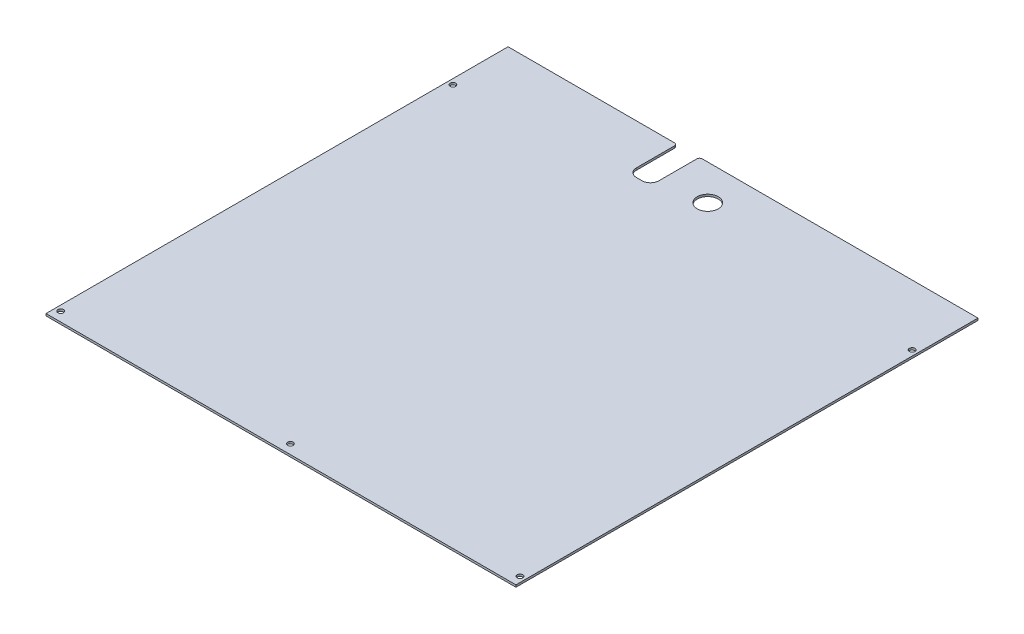
ISO-10303-21;
HEADER;
FILE_DESCRIPTION(('STEP AP214'),'2;1');
FILE_NAME('part.step','',(''),(''),'','','');
FILE_SCHEMA(('AUTOMOTIVE_DESIGN { 1 0 10303 214 1 1 1 1 }'));
ENDSEC;
DATA;
#1=APPLICATION_CONTEXT('core data for automotive mechanical design processes');
#2=APPLICATION_PROTOCOL_DEFINITION('international standard','automotive_design',2000,#1);
#3=PRODUCT_CONTEXT('',#1,'mechanical');
#4=PRODUCT('Part','Part','',(#3));
#5=PRODUCT_RELATED_PRODUCT_CATEGORY('part','',(#4));
#6=PRODUCT_DEFINITION_FORMATION('','',#4);
#7=PRODUCT_DEFINITION_CONTEXT('part definition',#1,'design');
#8=PRODUCT_DEFINITION('design','',#6,#7);
#9=PRODUCT_DEFINITION_SHAPE('','',#8);
#10=(LENGTH_UNIT() NAMED_UNIT(*) SI_UNIT(.MILLI.,.METRE.));
#11=(NAMED_UNIT(*) PLANE_ANGLE_UNIT() SI_UNIT($,.RADIAN.));
#12=(NAMED_UNIT(*) SI_UNIT($,.STERADIAN.) SOLID_ANGLE_UNIT());
#13=UNCERTAINTY_MEASURE_WITH_UNIT(LENGTH_MEASURE(1.E-05),#10,'distance_accuracy_value','');
#14=(GEOMETRIC_REPRESENTATION_CONTEXT(3) GLOBAL_UNCERTAINTY_ASSIGNED_CONTEXT((#13)) GLOBAL_UNIT_ASSIGNED_CONTEXT((#10,
#11,#12)) REPRESENTATION_CONTEXT('',''));
#15=CARTESIAN_POINT('',(0.,0.,0.));
#16=DIRECTION('',(0.,0.,1.));
#17=DIRECTION('',(1.,0.,0.));
#18=AXIS2_PLACEMENT_3D('',#15,#16,#17);
#19=CARTESIAN_POINT('',(-167.5,-1.5,-121.41));
#20=DIRECTION('',(0.,0.,-1.));
#21=DIRECTION('',(-1.,0.,0.));
#22=AXIS2_PLACEMENT_3D('',#19,#20,#21);
#23=PLANE('',#22);
#24=DIRECTION('',(-1.,0.,0.));
#25=VECTOR('',#24,1.);
#26=CARTESIAN_POINT('',(-167.5,0.,-121.41));
#27=LINE('',#26,#25);
#28=CARTESIAN_POINT('',(-49.,0.,-121.41));
#29=VERTEX_POINT('',#28);
#30=CARTESIAN_POINT('',(-167.5,0.,-121.41));
#31=VERTEX_POINT('',#30);
#32=EDGE_CURVE('E183',#29,#31,#27,.T.);
#33=ORIENTED_EDGE('',*,*,#32,.F.);
#34=DIRECTION('',(0.,1.,0.));
#35=VECTOR('',#34,1.);
#36=CARTESIAN_POINT('',(-49.,-1.5,-121.41));
#37=LINE('',#36,#35);
#38=CARTESIAN_POINT('',(-49.,-1.5,-121.41));
#39=VERTEX_POINT('',#38);
#40=EDGE_CURVE('E11',#29,#39,#37,.F.);
#41=ORIENTED_EDGE('',*,*,#40,.T.);
#42=DIRECTION('',(-1.,0.,0.));
#43=VECTOR('',#42,1.);
#44=CARTESIAN_POINT('',(-167.5,-1.5,-121.41));
#45=LINE('',#44,#43);
#46=CARTESIAN_POINT('',(-167.5,-1.5,-121.41));
#47=VERTEX_POINT('',#46);
#48=EDGE_CURVE('E159',#39,#47,#45,.T.);
#49=ORIENTED_EDGE('',*,*,#48,.T.);
#50=DIRECTION('',(0.,1.,0.));
#51=VECTOR('',#50,1.);
#52=CARTESIAN_POINT('',(-167.5,-1.5,-121.41));
#53=LINE('',#52,#51);
#54=EDGE_CURVE('E145',#47,#31,#53,.T.);
#55=ORIENTED_EDGE('',*,*,#54,.T.);
#56=EDGE_LOOP('',(#33,#41,#49,#55));
#57=FACE_BOUND('',#56,.T.);
#58=ADVANCED_FACE('F43',(#57),#23,.T.);
#59=CARTESIAN_POINT('',(167.5,-1.5,207.99));
#60=DIRECTION('',(1.,0.,0.));
#61=DIRECTION('',(0.,0.,-1.));
#62=AXIS2_PLACEMENT_3D('',#59,#60,#61);
#63=PLANE('',#62);
#64=DIRECTION('',(0.,0.,-1.));
#65=VECTOR('',#64,1.);
#66=CARTESIAN_POINT('',(167.5,0.,207.99));
#67=LINE('',#66,#65);
#68=CARTESIAN_POINT('',(167.5,0.,207.99));
#69=VERTEX_POINT('',#68);
#70=CARTESIAN_POINT('',(167.5,0.,-121.41));
#71=VERTEX_POINT('',#70);
#72=EDGE_CURVE('E180',#69,#71,#67,.T.);
#73=ORIENTED_EDGE('',*,*,#72,.F.);
#74=DIRECTION('',(0.,1.,0.));
#75=VECTOR('',#74,1.);
#76=CARTESIAN_POINT('',(167.5,-1.5,207.99));
#77=LINE('',#76,#75);
#78=CARTESIAN_POINT('',(167.5,-1.5,207.99));
#79=VERTEX_POINT('',#78);
#80=EDGE_CURVE('E162',#79,#69,#77,.T.);
#81=ORIENTED_EDGE('',*,*,#80,.F.);
#82=DIRECTION('',(0.,0.,-1.));
#83=VECTOR('',#82,1.);
#84=CARTESIAN_POINT('',(167.5,-1.5,207.99));
#85=LINE('',#84,#83);
#86=CARTESIAN_POINT('',(167.5,-1.5,-121.41));
#87=VERTEX_POINT('',#86);
#88=EDGE_CURVE('E153',#79,#87,#85,.T.);
#89=ORIENTED_EDGE('',*,*,#88,.T.);
#90=DIRECTION('',(0.,1.,0.));
#91=VECTOR('',#90,1.);
#92=CARTESIAN_POINT('',(167.5,-1.5,-121.41));
#93=LINE('',#92,#91);
#94=EDGE_CURVE('E132',#87,#71,#93,.T.);
#95=ORIENTED_EDGE('',*,*,#94,.T.);
#96=EDGE_LOOP('',(#73,#81,#89,#95));
#97=FACE_BOUND('',#96,.T.);
#98=ADVANCED_FACE('F161',(#97),#63,.T.);
#99=CARTESIAN_POINT('',(-167.5,-1.5,207.99));
#100=DIRECTION('',(0.,0.,1.));
#101=DIRECTION('',(1.,0.,0.));
#102=AXIS2_PLACEMENT_3D('',#99,#100,#101);
#103=PLANE('',#102);
#104=DIRECTION('',(1.,0.,0.));
#105=VECTOR('',#104,1.);
#106=CARTESIAN_POINT('',(-167.5,0.,207.99));
#107=LINE('',#106,#105);
#108=CARTESIAN_POINT('',(-167.5,0.,207.99));
#109=VERTEX_POINT('',#108);
#110=EDGE_CURVE('E164',#109,#69,#107,.T.);
#111=ORIENTED_EDGE('',*,*,#110,.F.);
#112=DIRECTION('',(0.,1.,0.));
#113=VECTOR('',#112,1.);
#114=CARTESIAN_POINT('',(-167.5,-1.5,207.99));
#115=LINE('',#114,#113);
#116=CARTESIAN_POINT('',(-167.5,-1.5,207.99));
#117=VERTEX_POINT('',#116);
#118=EDGE_CURVE('E193',#117,#109,#115,.T.);
#119=ORIENTED_EDGE('',*,*,#118,.F.);
#120=DIRECTION('',(1.,0.,0.));
#121=VECTOR('',#120,1.);
#122=CARTESIAN_POINT('',(-167.5,-1.5,207.99));
#123=LINE('',#122,#121);
#124=EDGE_CURVE('E146',#117,#79,#123,.T.);
#125=ORIENTED_EDGE('',*,*,#124,.T.);
#126=ORIENTED_EDGE('',*,*,#80,.T.);
#127=EDGE_LOOP('',(#111,#119,#125,#126));
#128=FACE_BOUND('',#127,.T.);
#129=ADVANCED_FACE('F335',(#128),#103,.T.);
#130=CARTESIAN_POINT('',(-167.5,-1.5,207.99));
#131=DIRECTION('',(-1.,0.,0.));
#132=DIRECTION('',(0.,0.,1.));
#133=AXIS2_PLACEMENT_3D('',#130,#131,#132);
#134=PLANE('',#133);
#135=DIRECTION('',(0.,0.,1.));
#136=VECTOR('',#135,1.);
#137=CARTESIAN_POINT('',(-167.5,0.,207.99));
#138=LINE('',#137,#136);
#139=EDGE_CURVE('E169',#31,#109,#138,.T.);
#140=ORIENTED_EDGE('',*,*,#139,.F.);
#141=ORIENTED_EDGE('',*,*,#54,.F.);
#142=DIRECTION('',(0.,0.,1.));
#143=VECTOR('',#142,1.);
#144=CARTESIAN_POINT('',(-167.5,-1.5,207.99));
#145=LINE('',#144,#143);
#146=EDGE_CURVE('E158',#47,#117,#145,.T.);
#147=ORIENTED_EDGE('',*,*,#146,.T.);
#148=ORIENTED_EDGE('',*,*,#118,.T.);
#149=EDGE_LOOP('',(#140,#141,#147,#148));
#150=FACE_BOUND('',#149,.T.);
#151=ADVANCED_FACE('F339',(#150),#134,.T.);
#152=CARTESIAN_POINT('',(-29.,-1.5,-121.41));
#153=VERTEX_POINT('',#152);
#154=EDGE_CURVE('E136',#87,#153,#45,.T.);
#155=ORIENTED_EDGE('',*,*,#154,.T.);
#156=DIRECTION('',(0.,1.,0.));
#157=VECTOR('',#156,1.);
#158=CARTESIAN_POINT('',(-29.,0.,-121.41));
#159=LINE('',#158,#157);
#160=CARTESIAN_POINT('',(-29.,0.,-121.41));
#161=VERTEX_POINT('',#160);
#162=EDGE_CURVE('E226',#153,#161,#159,.T.);
#163=ORIENTED_EDGE('',*,*,#162,.T.);
#164=EDGE_CURVE('E139',#71,#161,#27,.T.);
#165=ORIENTED_EDGE('',*,*,#164,.F.);
#166=ORIENTED_EDGE('',*,*,#94,.F.);
#167=EDGE_LOOP('',(#155,#163,#165,#166));
#168=FACE_BOUND('',#167,.T.);
#169=ADVANCED_FACE('F134',(#168),#23,.T.);
#170=CARTESIAN_POINT('',(0.,-1.5,0.));
#171=DIRECTION('',(0.,-1.,0.));
#172=DIRECTION('',(0.,0.,-1.));
#173=AXIS2_PLACEMENT_3D('',#170,#171,#172);
#174=PLANE('',#173);
#175=DIRECTION('',(0.,0.,-1.));
#176=VECTOR('',#175,1.);
#177=CARTESIAN_POINT('',(-31.,-1.5,-121.41));
#178=LINE('',#177,#176);
#179=CARTESIAN_POINT('',(-31.,-1.5,-92.41));
#180=VERTEX_POINT('',#179);
#181=CARTESIAN_POINT('',(-31.,-1.5,-119.41));
#182=VERTEX_POINT('',#181);
#183=EDGE_CURVE('E262',#180,#182,#178,.T.);
#184=ORIENTED_EDGE('',*,*,#183,.T.);
#185=CARTESIAN_POINT('',(-29.,-1.5,-119.41));
#186=DIRECTION('',(0.,-1.,0.));
#187=DIRECTION('',(0.,0.,-1.));
#188=AXIS2_PLACEMENT_3D('',#185,#186,#187);
#189=CIRCLE('',#188,2.);
#190=EDGE_CURVE('E156',#182,#153,#189,.T.);
#191=ORIENTED_EDGE('',*,*,#190,.T.);
#192=ORIENTED_EDGE('',*,*,#154,.F.);
#193=ORIENTED_EDGE('',*,*,#88,.F.);
#194=ORIENTED_EDGE('',*,*,#124,.F.);
#195=ORIENTED_EDGE('',*,*,#146,.F.);
#196=ORIENTED_EDGE('',*,*,#48,.F.);
#197=CARTESIAN_POINT('',(-49.,-1.5,-119.41));
#198=DIRECTION('',(0.,-1.,0.));
#199=DIRECTION('',(0.,0.,-1.));
#200=AXIS2_PLACEMENT_3D('',#197,#198,#199);
#201=CIRCLE('',#200,2.);
#202=CARTESIAN_POINT('',(-47.,-1.5,-119.41));
#203=VERTEX_POINT('',#202);
#204=EDGE_CURVE('E64',#39,#203,#201,.T.);
#205=ORIENTED_EDGE('',*,*,#204,.T.);
#206=DIRECTION('',(0.,0.,1.));
#207=VECTOR('',#206,1.);
#208=CARTESIAN_POINT('',(-47.,-1.5,-121.41));
#209=LINE('',#208,#207);
#210=CARTESIAN_POINT('',(-47.,-1.5,-92.41));
#211=VERTEX_POINT('',#210);
#212=EDGE_CURVE('E248',#203,#211,#209,.T.);
#213=ORIENTED_EDGE('',*,*,#212,.T.);
#214=CARTESIAN_POINT('',(-41.,-1.5,-92.41));
#215=DIRECTION('',(0.,-1.,0.));
#216=DIRECTION('',(0.,0.,-1.));
#217=AXIS2_PLACEMENT_3D('',#214,#215,#216);
#218=CIRCLE('',#217,6.);
#219=CARTESIAN_POINT('',(-41.,-1.5,-86.41));
#220=VERTEX_POINT('',#219);
#221=EDGE_CURVE('E223',#211,#220,#218,.F.);
#222=ORIENTED_EDGE('',*,*,#221,.T.);
#223=DIRECTION('',(1.,0.,0.));
#224=VECTOR('',#223,1.);
#225=CARTESIAN_POINT('',(-47.,-1.5,-86.41));
#226=LINE('',#225,#224);
#227=CARTESIAN_POINT('',(-37.,-1.5,-86.41));
#228=VERTEX_POINT('',#227);
#229=EDGE_CURVE('E384',#220,#228,#226,.T.);
#230=ORIENTED_EDGE('',*,*,#229,.T.);
#231=CARTESIAN_POINT('',(-37.,-1.5,-92.41));
#232=DIRECTION('',(0.,-1.,0.));
#233=DIRECTION('',(0.,0.,-1.));
#234=AXIS2_PLACEMENT_3D('',#231,#232,#233);
#235=CIRCLE('',#234,6.);
#236=EDGE_CURVE('E216',#228,#180,#235,.F.);
#237=ORIENTED_EDGE('',*,*,#236,.T.);
#238=EDGE_LOOP('',(#184,#191,#192,#193,#194,#195,#196,#205,#213,#222,#230,#237));
#239=FACE_BOUND('',#238,.T.);
#240=CARTESIAN_POINT('',(0.,-1.5,-96.25));
#241=DIRECTION('',(0.,-1.,0.));
#242=DIRECTION('',(0.,0.,-1.));
#243=AXIS2_PLACEMENT_3D('',#240,#241,#242);
#244=CIRCLE('',#243,7.5);
#245=CARTESIAN_POINT('',(0.,-1.5,-103.75));
#246=VERTEX_POINT('',#245);
#247=EDGE_CURVE('E273',#246,#246,#244,.F.);
#248=ORIENTED_EDGE('',*,*,#247,.T.);
#249=EDGE_LOOP('',(#248));
#250=FACE_BOUND('',#249,.T.);
#251=CARTESIAN_POINT('',(0.,-1.5,201.3));
#252=DIRECTION('',(0.,-1.,0.));
#253=DIRECTION('',(0.,0.,-1.));
#254=AXIS2_PLACEMENT_3D('',#251,#252,#253);
#255=CIRCLE('',#254,2.);
#256=CARTESIAN_POINT('',(0.,-1.5,199.3));
#257=VERTEX_POINT('',#256);
#258=EDGE_CURVE('E272',#257,#257,#255,.F.);
#259=ORIENTED_EDGE('',*,*,#258,.T.);
#260=EDGE_LOOP('',(#259));
#261=FACE_BOUND('',#260,.T.);
#262=CARTESIAN_POINT('',(163.7,-1.5,201.3));
#263=DIRECTION('',(0.,-1.,0.));
#264=DIRECTION('',(0.,0.,-1.));
#265=AXIS2_PLACEMENT_3D('',#262,#263,#264);
#266=CIRCLE('',#265,2.);
#267=CARTESIAN_POINT('',(163.7,-1.5,199.3));
#268=VERTEX_POINT('',#267);
#269=EDGE_CURVE('E281',#268,#268,#266,.F.);
#270=ORIENTED_EDGE('',*,*,#269,.T.);
#271=EDGE_LOOP('',(#270));
#272=FACE_BOUND('',#271,.T.);
#273=CARTESIAN_POINT('',(163.7,-1.5,-78.26));
#274=DIRECTION('',(0.,-1.,0.));
#275=DIRECTION('',(0.,0.,-1.));
#276=AXIS2_PLACEMENT_3D('',#273,#274,#275);
#277=CIRCLE('',#276,2.);
#278=CARTESIAN_POINT('',(163.7,-1.5,-80.26));
#279=VERTEX_POINT('',#278);
#280=EDGE_CURVE('E289',#279,#279,#277,.F.);
#281=ORIENTED_EDGE('',*,*,#280,.T.);
#282=EDGE_LOOP('',(#281));
#283=FACE_BOUND('',#282,.T.);
#284=CARTESIAN_POINT('',(-163.7,-1.5,-78.2599999999999));
#285=DIRECTION('',(0.,-1.,0.));
#286=DIRECTION('',(0.,0.,-1.));
#287=AXIS2_PLACEMENT_3D('',#284,#285,#286);
#288=CIRCLE('',#287,2.);
#289=CARTESIAN_POINT('',(-163.7,-1.5,-80.2599999999999));
#290=VERTEX_POINT('',#289);
#291=EDGE_CURVE('E297',#290,#290,#288,.F.);
#292=ORIENTED_EDGE('',*,*,#291,.T.);
#293=EDGE_LOOP('',(#292));
#294=FACE_BOUND('',#293,.T.);
#295=CARTESIAN_POINT('',(-163.7,-1.5,201.3));
#296=DIRECTION('',(0.,-1.,0.));
#297=DIRECTION('',(0.,0.,-1.));
#298=AXIS2_PLACEMENT_3D('',#295,#296,#297);
#299=CIRCLE('',#298,2.);
#300=CARTESIAN_POINT('',(-163.7,-1.5,199.3));
#301=VERTEX_POINT('',#300);
#302=EDGE_CURVE('E172',#301,#301,#299,.F.);
#303=ORIENTED_EDGE('',*,*,#302,.T.);
#304=EDGE_LOOP('',(#303));
#305=FACE_BOUND('',#304,.T.);
#306=ADVANCED_FACE('F150',(#239,#250,#261,#272,#283,#294,#305),#174,.T.);
#307=CARTESIAN_POINT('',(0.,0.,0.));
#308=DIRECTION('',(0.,-1.,0.));
#309=DIRECTION('',(0.,0.,-1.));
#310=AXIS2_PLACEMENT_3D('',#307,#308,#309);
#311=PLANE('',#310);
#312=CARTESIAN_POINT('',(0.,0.,-96.25));
#313=DIRECTION('',(0.,1.,0.));
#314=DIRECTION('',(0.,0.,1.));
#315=AXIS2_PLACEMENT_3D('',#312,#313,#314);
#316=CIRCLE('',#315,7.5);
#317=CARTESIAN_POINT('',(0.,0.,-88.75));
#318=VERTEX_POINT('',#317);
#319=EDGE_CURVE('E268',#318,#318,#316,.T.);
#320=ORIENTED_EDGE('',*,*,#319,.F.);
#321=EDGE_LOOP('',(#320));
#322=FACE_BOUND('',#321,.T.);
#323=CARTESIAN_POINT('',(0.,0.,201.3));
#324=DIRECTION('',(0.,1.,0.));
#325=DIRECTION('',(0.,0.,1.));
#326=AXIS2_PLACEMENT_3D('',#323,#324,#325);
#327=CIRCLE('',#326,2.);
#328=CARTESIAN_POINT('',(0.,0.,203.3));
#329=VERTEX_POINT('',#328);
#330=EDGE_CURVE('E277',#329,#329,#327,.T.);
#331=ORIENTED_EDGE('',*,*,#330,.F.);
#332=EDGE_LOOP('',(#331));
#333=FACE_BOUND('',#332,.T.);
#334=CARTESIAN_POINT('',(163.7,0.,201.3));
#335=DIRECTION('',(0.,1.,0.));
#336=DIRECTION('',(0.,0.,-1.));
#337=AXIS2_PLACEMENT_3D('',#334,#335,#336);
#338=CIRCLE('',#337,2.);
#339=CARTESIAN_POINT('',(163.7,0.,199.3));
#340=VERTEX_POINT('',#339);
#341=EDGE_CURVE('E285',#340,#340,#338,.T.);
#342=ORIENTED_EDGE('',*,*,#341,.F.);
#343=EDGE_LOOP('',(#342));
#344=FACE_BOUND('',#343,.T.);
#345=CARTESIAN_POINT('',(163.7,0.,-78.26));
#346=DIRECTION('',(0.,1.,0.));
#347=DIRECTION('',(0.,0.,-1.));
#348=AXIS2_PLACEMENT_3D('',#345,#346,#347);
#349=CIRCLE('',#348,2.);
#350=CARTESIAN_POINT('',(163.7,0.,-80.26));
#351=VERTEX_POINT('',#350);
#352=EDGE_CURVE('E293',#351,#351,#349,.T.);
#353=ORIENTED_EDGE('',*,*,#352,.F.);
#354=EDGE_LOOP('',(#353));
#355=FACE_BOUND('',#354,.T.);
#356=CARTESIAN_POINT('',(-163.7,0.,-78.2599999999999));
#357=DIRECTION('',(0.,1.,0.));
#358=DIRECTION('',(0.,0.,1.));
#359=AXIS2_PLACEMENT_3D('',#356,#357,#358);
#360=CIRCLE('',#359,2.);
#361=CARTESIAN_POINT('',(-163.7,0.,-76.2599999999999));
#362=VERTEX_POINT('',#361);
#363=EDGE_CURVE('E301',#362,#362,#360,.T.);
#364=ORIENTED_EDGE('',*,*,#363,.F.);
#365=EDGE_LOOP('',(#364));
#366=FACE_BOUND('',#365,.T.);
#367=CARTESIAN_POINT('',(-163.7,0.,201.3));
#368=DIRECTION('',(0.,1.,0.));
#369=DIRECTION('',(0.,0.,1.));
#370=AXIS2_PLACEMENT_3D('',#367,#368,#369);
#371=CIRCLE('',#370,2.);
#372=CARTESIAN_POINT('',(-163.7,0.,203.3));
#373=VERTEX_POINT('',#372);
#374=EDGE_CURVE('E184',#373,#373,#371,.T.);
#375=ORIENTED_EDGE('',*,*,#374,.F.);
#376=EDGE_LOOP('',(#375));
#377=FACE_BOUND('',#376,.T.);
#378=ORIENTED_EDGE('',*,*,#164,.T.);
#379=CARTESIAN_POINT('',(-29.,0.,-119.41));
#380=DIRECTION('',(0.,-1.,0.));
#381=DIRECTION('',(0.,0.,-1.));
#382=AXIS2_PLACEMENT_3D('',#379,#380,#381);
#383=CIRCLE('',#382,2.);
#384=CARTESIAN_POINT('',(-31.,0.,-119.41));
#385=VERTEX_POINT('',#384);
#386=EDGE_CURVE('E232',#161,#385,#383,.F.);
#387=ORIENTED_EDGE('',*,*,#386,.T.);
#388=DIRECTION('',(0.,0.,-1.));
#389=VECTOR('',#388,1.);
#390=CARTESIAN_POINT('',(-31.,0.,-121.41));
#391=LINE('',#390,#389);
#392=CARTESIAN_POINT('',(-31.,0.,-92.41));
#393=VERTEX_POINT('',#392);
#394=EDGE_CURVE('E259',#393,#385,#391,.T.);
#395=ORIENTED_EDGE('',*,*,#394,.F.);
#396=CARTESIAN_POINT('',(-37.,0.,-92.41));
#397=DIRECTION('',(0.,-1.,0.));
#398=DIRECTION('',(0.,0.,-1.));
#399=AXIS2_PLACEMENT_3D('',#396,#397,#398);
#400=CIRCLE('',#399,6.);
#401=CARTESIAN_POINT('',(-37.,0.,-86.41));
#402=VERTEX_POINT('',#401);
#403=EDGE_CURVE('E213',#393,#402,#400,.T.);
#404=ORIENTED_EDGE('',*,*,#403,.T.);
#405=DIRECTION('',(1.,0.,0.));
#406=VECTOR('',#405,1.);
#407=CARTESIAN_POINT('',(-47.,0.,-86.41));
#408=LINE('',#407,#406);
#409=CARTESIAN_POINT('',(-41.,0.,-86.41));
#410=VERTEX_POINT('',#409);
#411=EDGE_CURVE('E255',#410,#402,#408,.T.);
#412=ORIENTED_EDGE('',*,*,#411,.F.);
#413=CARTESIAN_POINT('',(-41.,0.,-92.41));
#414=DIRECTION('',(0.,-1.,0.));
#415=DIRECTION('',(0.,0.,-1.));
#416=AXIS2_PLACEMENT_3D('',#413,#414,#415);
#417=CIRCLE('',#416,6.);
#418=CARTESIAN_POINT('',(-47.,0.,-92.41));
#419=VERTEX_POINT('',#418);
#420=EDGE_CURVE('E219',#410,#419,#417,.T.);
#421=ORIENTED_EDGE('',*,*,#420,.T.);
#422=DIRECTION('',(0.,0.,1.));
#423=VECTOR('',#422,1.);
#424=CARTESIAN_POINT('',(-47.,0.,-121.41));
#425=LINE('',#424,#423);
#426=CARTESIAN_POINT('',(-47.,0.,-119.41));
#427=VERTEX_POINT('',#426);
#428=EDGE_CURVE('E247',#427,#419,#425,.T.);
#429=ORIENTED_EDGE('',*,*,#428,.F.);
#430=CARTESIAN_POINT('',(-49.,0.,-119.41));
#431=DIRECTION('',(0.,-1.,0.));
#432=DIRECTION('',(0.,0.,-1.));
#433=AXIS2_PLACEMENT_3D('',#430,#431,#432);
#434=CIRCLE('',#433,2.);
#435=EDGE_CURVE('E229',#427,#29,#434,.F.);
#436=ORIENTED_EDGE('',*,*,#435,.T.);
#437=ORIENTED_EDGE('',*,*,#32,.T.);
#438=ORIENTED_EDGE('',*,*,#139,.T.);
#439=ORIENTED_EDGE('',*,*,#110,.T.);
#440=ORIENTED_EDGE('',*,*,#72,.T.);
#441=EDGE_LOOP('',(#378,#387,#395,#404,#412,#421,#429,#436,#437,#438,#439,#440));
#442=FACE_BOUND('',#441,.T.);
#443=ADVANCED_FACE('F251',(#322,#333,#344,#355,#366,#377,#442),#311,.F.);
#444=CARTESIAN_POINT('',(-163.7,-1.501,201.3));
#445=DIRECTION('',(0.,1.,0.));
#446=DIRECTION('',(0.,0.,1.));
#447=AXIS2_PLACEMENT_3D('',#444,#445,#446);
#448=CYLINDRICAL_SURFACE('',#447,2.);
#449=ORIENTED_EDGE('',*,*,#302,.F.);
#450=EDGE_LOOP('',(#449));
#451=FACE_BOUND('',#450,.T.);
#452=ORIENTED_EDGE('',*,*,#374,.T.);
#453=EDGE_LOOP('',(#452));
#454=FACE_BOUND('',#453,.T.);
#455=ADVANCED_FACE('F316',(#451,#454),#448,.F.);
#456=CARTESIAN_POINT('',(-163.7,-1.501,-78.2599999999999));
#457=DIRECTION('',(0.,1.,0.));
#458=DIRECTION('',(0.,0.,1.));
#459=AXIS2_PLACEMENT_3D('',#456,#457,#458);
#460=CYLINDRICAL_SURFACE('',#459,2.);
#461=ORIENTED_EDGE('',*,*,#291,.F.);
#462=EDGE_LOOP('',(#461));
#463=FACE_BOUND('',#462,.T.);
#464=ORIENTED_EDGE('',*,*,#363,.T.);
#465=EDGE_LOOP('',(#464));
#466=FACE_BOUND('',#465,.T.);
#467=ADVANCED_FACE('F318',(#463,#466),#460,.F.);
#468=CARTESIAN_POINT('',(163.7,-1.501,-78.26));
#469=DIRECTION('',(0.,1.,0.));
#470=DIRECTION('',(0.,0.,1.));
#471=AXIS2_PLACEMENT_3D('',#468,#469,#470);
#472=CYLINDRICAL_SURFACE('',#471,2.);
#473=ORIENTED_EDGE('',*,*,#280,.F.);
#474=EDGE_LOOP('',(#473));
#475=FACE_BOUND('',#474,.T.);
#476=ORIENTED_EDGE('',*,*,#352,.T.);
#477=EDGE_LOOP('',(#476));
#478=FACE_BOUND('',#477,.T.);
#479=ADVANCED_FACE('F324',(#475,#478),#472,.F.);
#480=CARTESIAN_POINT('',(163.7,-1.501,201.3));
#481=DIRECTION('',(0.,1.,0.));
#482=DIRECTION('',(0.,0.,1.));
#483=AXIS2_PLACEMENT_3D('',#480,#481,#482);
#484=CYLINDRICAL_SURFACE('',#483,2.);
#485=ORIENTED_EDGE('',*,*,#269,.F.);
#486=EDGE_LOOP('',(#485));
#487=FACE_BOUND('',#486,.T.);
#488=ORIENTED_EDGE('',*,*,#341,.T.);
#489=EDGE_LOOP('',(#488));
#490=FACE_BOUND('',#489,.T.);
#491=ADVANCED_FACE('F405',(#487,#490),#484,.F.);
#492=CARTESIAN_POINT('',(0.,-1.501,201.3));
#493=DIRECTION('',(0.,1.,0.));
#494=DIRECTION('',(0.,0.,1.));
#495=AXIS2_PLACEMENT_3D('',#492,#493,#494);
#496=CYLINDRICAL_SURFACE('',#495,2.);
#497=ORIENTED_EDGE('',*,*,#258,.F.);
#498=EDGE_LOOP('',(#497));
#499=FACE_BOUND('',#498,.T.);
#500=ORIENTED_EDGE('',*,*,#330,.T.);
#501=EDGE_LOOP('',(#500));
#502=FACE_BOUND('',#501,.T.);
#503=ADVANCED_FACE('F401',(#499,#502),#496,.F.);
#504=CARTESIAN_POINT('',(0.,-1.501,-96.25));
#505=DIRECTION('',(0.,1.,0.));
#506=DIRECTION('',(0.,0.,1.));
#507=AXIS2_PLACEMENT_3D('',#504,#505,#506);
#508=CYLINDRICAL_SURFACE('',#507,7.5);
#509=ORIENTED_EDGE('',*,*,#247,.F.);
#510=EDGE_LOOP('',(#509));
#511=FACE_BOUND('',#510,.T.);
#512=ORIENTED_EDGE('',*,*,#319,.T.);
#513=EDGE_LOOP('',(#512));
#514=FACE_BOUND('',#513,.T.);
#515=ADVANCED_FACE('F398',(#511,#514),#508,.F.);
#516=CARTESIAN_POINT('',(-47.,-1.5,-121.41));
#517=DIRECTION('',(-1.,0.,0.));
#518=DIRECTION('',(0.,0.,1.));
#519=AXIS2_PLACEMENT_3D('',#516,#517,#518);
#520=PLANE('',#519);
#521=ORIENTED_EDGE('',*,*,#212,.F.);
#522=DIRECTION('',(0.,1.,0.));
#523=VECTOR('',#522,1.);
#524=CARTESIAN_POINT('',(-47.,0.,-119.41));
#525=LINE('',#524,#523);
#526=EDGE_CURVE('E52',#203,#427,#525,.T.);
#527=ORIENTED_EDGE('',*,*,#526,.T.);
#528=ORIENTED_EDGE('',*,*,#428,.T.);
#529=DIRECTION('',(0.,1.,0.));
#530=VECTOR('',#529,1.);
#531=CARTESIAN_POINT('',(-47.,-1.5,-92.41));
#532=LINE('',#531,#530);
#533=EDGE_CURVE('E209',#419,#211,#532,.F.);
#534=ORIENTED_EDGE('',*,*,#533,.T.);
#535=EDGE_LOOP('',(#521,#527,#528,#534));
#536=FACE_BOUND('',#535,.T.);
#537=ADVANCED_FACE('F246',(#536),#520,.F.);
#538=CARTESIAN_POINT('',(-31.,-1.5,-121.41));
#539=DIRECTION('',(1.,0.,0.));
#540=DIRECTION('',(0.,0.,-1.));
#541=AXIS2_PLACEMENT_3D('',#538,#539,#540);
#542=PLANE('',#541);
#543=ORIENTED_EDGE('',*,*,#394,.T.);
#544=DIRECTION('',(0.,1.,0.));
#545=VECTOR('',#544,1.);
#546=CARTESIAN_POINT('',(-31.,-1.5,-119.41));
#547=LINE('',#546,#545);
#548=EDGE_CURVE('E235',#385,#182,#547,.F.);
#549=ORIENTED_EDGE('',*,*,#548,.T.);
#550=ORIENTED_EDGE('',*,*,#183,.F.);
#551=DIRECTION('',(0.,1.,0.));
#552=VECTOR('',#551,1.);
#553=CARTESIAN_POINT('',(-31.,0.,-92.41));
#554=LINE('',#553,#552);
#555=EDGE_CURVE('E192',#180,#393,#554,.T.);
#556=ORIENTED_EDGE('',*,*,#555,.T.);
#557=EDGE_LOOP('',(#543,#549,#550,#556));
#558=FACE_BOUND('',#557,.T.);
#559=ADVANCED_FACE('F358',(#558),#542,.F.);
#560=CARTESIAN_POINT('',(-47.,-1.5,-86.41));
#561=DIRECTION('',(0.,0.,1.));
#562=DIRECTION('',(1.,0.,0.));
#563=AXIS2_PLACEMENT_3D('',#560,#561,#562);
#564=PLANE('',#563);
#565=ORIENTED_EDGE('',*,*,#411,.T.);
#566=DIRECTION('',(0.,1.,0.));
#567=VECTOR('',#566,1.);
#568=CARTESIAN_POINT('',(-37.,-1.5,-86.41));
#569=LINE('',#568,#567);
#570=EDGE_CURVE('E206',#402,#228,#569,.F.);
#571=ORIENTED_EDGE('',*,*,#570,.T.);
#572=ORIENTED_EDGE('',*,*,#229,.F.);
#573=DIRECTION('',(0.,1.,0.));
#574=VECTOR('',#573,1.);
#575=CARTESIAN_POINT('',(-41.,0.,-86.41));
#576=LINE('',#575,#574);
#577=EDGE_CURVE('E202',#220,#410,#576,.T.);
#578=ORIENTED_EDGE('',*,*,#577,.T.);
#579=EDGE_LOOP('',(#565,#571,#572,#578));
#580=FACE_BOUND('',#579,.T.);
#581=ADVANCED_FACE('F373',(#580),#564,.F.);
#582=CARTESIAN_POINT('',(-37.,-1.5,-92.41));
#583=DIRECTION('',(0.,-1.,0.));
#584=DIRECTION('',(0.,0.,-1.));
#585=AXIS2_PLACEMENT_3D('',#582,#583,#584);
#586=CYLINDRICAL_SURFACE('',#585,6.);
#587=ORIENTED_EDGE('',*,*,#236,.F.);
#588=ORIENTED_EDGE('',*,*,#570,.F.);
#589=ORIENTED_EDGE('',*,*,#403,.F.);
#590=ORIENTED_EDGE('',*,*,#555,.F.);
#591=EDGE_LOOP('',(#587,#588,#589,#590));
#592=FACE_BOUND('',#591,.T.);
#593=ADVANCED_FACE('F368',(#592),#586,.F.);
#594=CARTESIAN_POINT('',(-41.,-1.5,-92.41));
#595=DIRECTION('',(0.,-1.,0.));
#596=DIRECTION('',(0.,0.,-1.));
#597=AXIS2_PLACEMENT_3D('',#594,#595,#596);
#598=CYLINDRICAL_SURFACE('',#597,6.);
#599=ORIENTED_EDGE('',*,*,#221,.F.);
#600=ORIENTED_EDGE('',*,*,#533,.F.);
#601=ORIENTED_EDGE('',*,*,#420,.F.);
#602=ORIENTED_EDGE('',*,*,#577,.F.);
#603=EDGE_LOOP('',(#599,#600,#601,#602));
#604=FACE_BOUND('',#603,.T.);
#605=ADVANCED_FACE('F363',(#604),#598,.F.);
#606=CARTESIAN_POINT('',(-29.,-1.5,-119.41));
#607=DIRECTION('',(0.,-1.,0.));
#608=DIRECTION('',(0.,0.,-1.));
#609=AXIS2_PLACEMENT_3D('',#606,#607,#608);
#610=CYLINDRICAL_SURFACE('',#609,2.);
#611=ORIENTED_EDGE('',*,*,#190,.F.);
#612=ORIENTED_EDGE('',*,*,#548,.F.);
#613=ORIENTED_EDGE('',*,*,#386,.F.);
#614=ORIENTED_EDGE('',*,*,#162,.F.);
#615=EDGE_LOOP('',(#611,#612,#613,#614));
#616=FACE_BOUND('',#615,.T.);
#617=ADVANCED_FACE('F361',(#616),#610,.T.);
#618=CARTESIAN_POINT('',(-49.,-1.5,-119.41));
#619=DIRECTION('',(0.,-1.,0.));
#620=DIRECTION('',(0.,0.,-1.));
#621=AXIS2_PLACEMENT_3D('',#618,#619,#620);
#622=CYLINDRICAL_SURFACE('',#621,2.);
#623=ORIENTED_EDGE('',*,*,#204,.F.);
#624=ORIENTED_EDGE('',*,*,#40,.F.);
#625=ORIENTED_EDGE('',*,*,#435,.F.);
#626=ORIENTED_EDGE('',*,*,#526,.F.);
#627=EDGE_LOOP('',(#623,#624,#625,#626));
#628=FACE_BOUND('',#627,.T.);
#629=ADVANCED_FACE('F45',(#628),#622,.T.);
#630=CLOSED_SHELL('',(#58,#98,#129,#151,#169,#306,#443,#455,#467,#479,#491,#503,#515,#537,#559,
#581,#593,#605,#617,#629));
#631=MANIFOLD_SOLID_BREP('B2',#630);
#632=ADVANCED_BREP_SHAPE_REPRESENTATION('',(#18,#631),#14);
#633=SHAPE_DEFINITION_REPRESENTATION(#9,#632);
ENDSEC;
END-ISO-10303-21;
